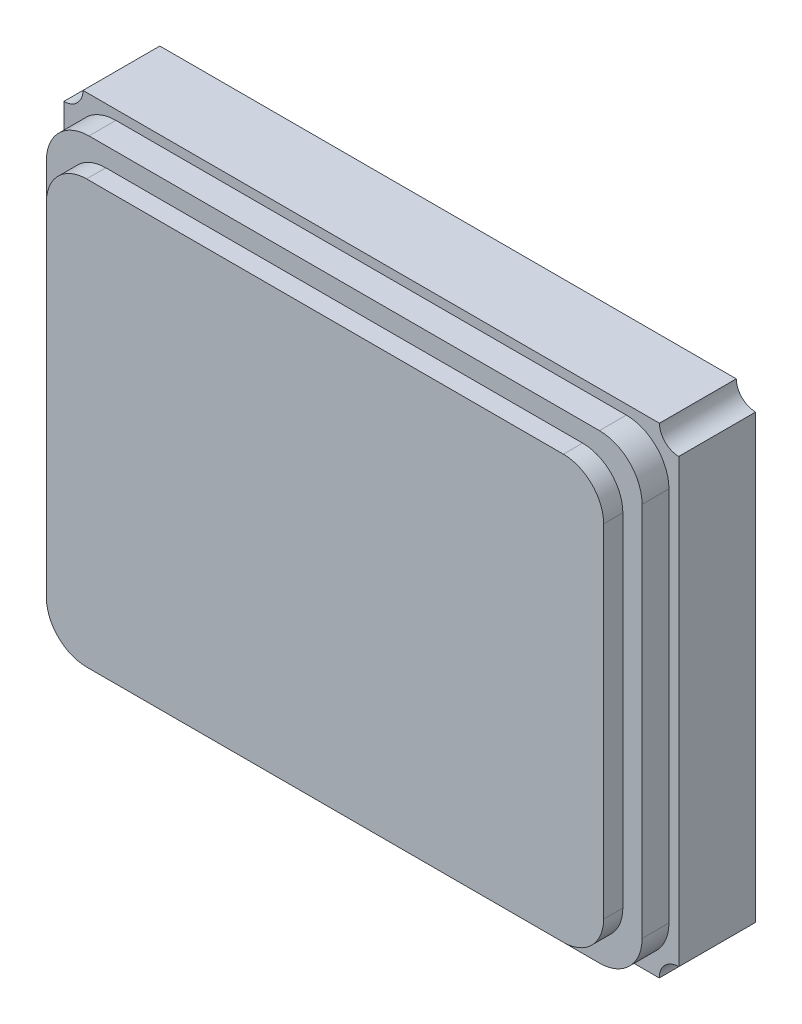
ISO-10303-21;
HEADER;
FILE_DESCRIPTION(('STEP AP214'),'2;1');
FILE_NAME('part.step','',(''),(''),'','','');
FILE_SCHEMA(('AUTOMOTIVE_DESIGN { 1 0 10303 214 1 1 1 1 }'));
ENDSEC;
DATA;
#1=APPLICATION_CONTEXT('core data for automotive mechanical design processes');
#2=APPLICATION_PROTOCOL_DEFINITION('international standard','automotive_design',2000,#1);
#3=PRODUCT_CONTEXT('',#1,'mechanical');
#4=PRODUCT('Part','Part','',(#3));
#5=PRODUCT_RELATED_PRODUCT_CATEGORY('part','',(#4));
#6=PRODUCT_DEFINITION_FORMATION('','',#4);
#7=PRODUCT_DEFINITION_CONTEXT('part definition',#1,'design');
#8=PRODUCT_DEFINITION('design','',#6,#7);
#9=PRODUCT_DEFINITION_SHAPE('','',#8);
#10=(LENGTH_UNIT() NAMED_UNIT(*) SI_UNIT(.MILLI.,.METRE.));
#11=(NAMED_UNIT(*) PLANE_ANGLE_UNIT() SI_UNIT($,.RADIAN.));
#12=(NAMED_UNIT(*) SI_UNIT($,.STERADIAN.) SOLID_ANGLE_UNIT());
#13=UNCERTAINTY_MEASURE_WITH_UNIT(LENGTH_MEASURE(1.E-05),#10,'distance_accuracy_value','');
#14=(GEOMETRIC_REPRESENTATION_CONTEXT(3) GLOBAL_UNCERTAINTY_ASSIGNED_CONTEXT((#13)) GLOBAL_UNIT_ASSIGNED_CONTEXT((#10,
#11,#12)) REPRESENTATION_CONTEXT('',''));
#15=CARTESIAN_POINT('',(0.,0.,0.));
#16=DIRECTION('',(0.,0.,1.));
#17=DIRECTION('',(1.,0.,0.));
#18=AXIS2_PLACEMENT_3D('',#15,#16,#17);
#19=CARTESIAN_POINT('',(0.0008802163144183,-0.0008850774637298,0.));
#20=DIRECTION('',(0.,0.,1.));
#21=DIRECTION('',(1.,0.,0.));
#22=AXIS2_PLACEMENT_3D('',#19,#20,#21);
#23=PLANE('',#22);
#24=DIRECTION('',(1.,0.,0.));
#25=VECTOR('',#24,1.);
#26=CARTESIAN_POINT('',(-1.499580396422,1.249506131818,0.));
#27=LINE('',#26,#25);
#28=CARTESIAN_POINT('',(-1.499580396422,1.249506131818,0.));
#29=VERTEX_POINT('',#28);
#30=CARTESIAN_POINT('',(1.500419603578,1.249506131818,0.));
#31=VERTEX_POINT('',#30);
#32=EDGE_CURVE('E376',#29,#31,#27,.T.);
#33=ORIENTED_EDGE('',*,*,#32,.T.);
#34=CARTESIAN_POINT('',(1.600419603578,1.250214196517,0.));
#35=DIRECTION('',(0.,0.,1.));
#36=DIRECTION('',(1.,0.,0.));
#37=AXIS2_PLACEMENT_3D('',#34,#35,#36);
#38=CIRCLE('',#37,0.100002506747);
#39=CARTESIAN_POINT('',(1.601127668277,1.150214196517,0.));
#40=VERTEX_POINT('',#39);
#41=EDGE_CURVE('E393',#31,#40,#38,.T.);
#42=ORIENTED_EDGE('',*,*,#41,.T.);
#43=DIRECTION('',(0.,-1.,0.));
#44=VECTOR('',#43,1.);
#45=CARTESIAN_POINT('',(1.601127668277,1.150214196517,0.));
#46=LINE('',#45,#44);
#47=CARTESIAN_POINT('',(1.601127668277,-1.149785803483,0.));
#48=VERTEX_POINT('',#47);
#49=EDGE_CURVE('E389',#40,#48,#46,.T.);
#50=ORIENTED_EDGE('',*,*,#49,.T.);
#51=CARTESIAN_POINT('',(1.599580396422,-1.249785803483,0.));
#52=DIRECTION('',(0.,0.,1.));
#53=DIRECTION('',(1.,0.,0.));
#54=AXIS2_PLACEMENT_3D('',#51,#52,#53);
#55=CIRCLE('',#54,0.100011969535);
#56=CARTESIAN_POINT('',(1.499580396422,-1.251333075338,0.));
#57=VERTEX_POINT('',#56);
#58=EDGE_CURVE('E25',#48,#57,#55,.T.);
#59=ORIENTED_EDGE('',*,*,#58,.T.);
#60=DIRECTION('',(-1.,0.,0.));
#61=VECTOR('',#60,1.);
#62=CARTESIAN_POINT('',(1.499580396422,-1.251333075338,0.));
#63=LINE('',#62,#61);
#64=CARTESIAN_POINT('',(-1.500419603578,-1.251333075338,0.));
#65=VERTEX_POINT('',#64);
#66=EDGE_CURVE('E11',#57,#65,#63,.T.);
#67=ORIENTED_EDGE('',*,*,#66,.T.);
#68=CARTESIAN_POINT('',(-1.600419603578,-1.250214196517,0.));
#69=DIRECTION('',(0.,0.,1.));
#70=DIRECTION('',(1.,0.,0.));
#71=AXIS2_PLACEMENT_3D('',#68,#69,#70);
#72=CIRCLE('',#71,0.100006259253);
#73=CARTESIAN_POINT('',(-1.599300724757,-1.150214196517,0.));
#74=VERTEX_POINT('',#73);
#75=EDGE_CURVE('E330',#65,#74,#72,.T.);
#76=ORIENTED_EDGE('',*,*,#75,.T.);
#77=DIRECTION('',(0.,1.,0.));
#78=VECTOR('',#77,1.);
#79=CARTESIAN_POINT('',(-1.599300724757,-1.150214196517,0.));
#80=LINE('',#79,#78);
#81=CARTESIAN_POINT('',(-1.599300724757,1.149785803483,0.));
#82=VERTEX_POINT('',#81);
#83=EDGE_CURVE('E390',#74,#82,#80,.T.);
#84=ORIENTED_EDGE('',*,*,#83,.T.);
#85=CARTESIAN_POINT('',(-1.599580396422,1.249785803483,0.));
#86=DIRECTION('',(0.,0.,1.));
#87=DIRECTION('',(1.,0.,0.));
#88=AXIS2_PLACEMENT_3D('',#85,#86,#87);
#89=CIRCLE('',#88,0.10000039108);
#90=EDGE_CURVE('E382',#82,#29,#89,.T.);
#91=ORIENTED_EDGE('',*,*,#90,.T.);
#92=EDGE_LOOP('',(#33,#42,#50,#59,#67,#76,#84,#91));
#93=FACE_BOUND('',#92,.T.);
#94=ADVANCED_FACE('F17',(#93),#23,.F.);
#95=CARTESIAN_POINT('',(1.499580396422,-1.251333075338,0.));
#96=DIRECTION('',(0.,-1.,0.));
#97=DIRECTION('',(0.,0.,-1.));
#98=AXIS2_PLACEMENT_3D('',#95,#96,#97);
#99=PLANE('',#98);
#100=DIRECTION('',(0.,0.,1.));
#101=VECTOR('',#100,1.);
#102=CARTESIAN_POINT('',(1.499580396422,-1.251333075338,0.));
#103=LINE('',#102,#101);
#104=CARTESIAN_POINT('',(1.499580396422,-1.251333075338,0.4));
#105=VERTEX_POINT('',#104);
#106=EDGE_CURVE('E327',#57,#105,#103,.T.);
#107=ORIENTED_EDGE('',*,*,#106,.T.);
#108=DIRECTION('',(-1.,0.,0.));
#109=VECTOR('',#108,1.);
#110=CARTESIAN_POINT('',(1.499580396422,-1.251333075338,0.4));
#111=LINE('',#110,#109);
#112=CARTESIAN_POINT('',(-1.500419603578,-1.251333075338,0.4));
#113=VERTEX_POINT('',#112);
#114=EDGE_CURVE('E348',#105,#113,#111,.T.);
#115=ORIENTED_EDGE('',*,*,#114,.T.);
#116=DIRECTION('',(0.,0.,1.));
#117=VECTOR('',#116,1.);
#118=CARTESIAN_POINT('',(-1.500419603578,-1.251333075338,0.));
#119=LINE('',#118,#117);
#120=EDGE_CURVE('E336',#65,#113,#119,.T.);
#121=ORIENTED_EDGE('',*,*,#120,.F.);
#122=ORIENTED_EDGE('',*,*,#66,.F.);
#123=EDGE_LOOP('',(#107,#115,#121,#122));
#124=FACE_BOUND('',#123,.T.);
#125=ADVANCED_FACE('F409',(#124),#99,.T.);
#126=CARTESIAN_POINT('',(1.599580396422,-1.249785803483,0.));
#127=DIRECTION('',(0.,0.,-1.));
#128=DIRECTION('',(1.,0.,0.));
#129=AXIS2_PLACEMENT_3D('',#126,#127,#128);
#130=CYLINDRICAL_SURFACE('',#129,0.100011969535);
#131=DIRECTION('',(0.,0.,1.));
#132=VECTOR('',#131,1.);
#133=CARTESIAN_POINT('',(1.601127668277,-1.149785803483,0.));
#134=LINE('',#133,#132);
#135=CARTESIAN_POINT('',(1.601127668277,-1.149785803483,0.4));
#136=VERTEX_POINT('',#135);
#137=EDGE_CURVE('E386',#48,#136,#134,.T.);
#138=ORIENTED_EDGE('',*,*,#137,.T.);
#139=CARTESIAN_POINT('',(1.599580396422,-1.249785803483,0.4));
#140=DIRECTION('',(0.,0.,1.));
#141=DIRECTION('',(1.,0.,0.));
#142=AXIS2_PLACEMENT_3D('',#139,#140,#141);
#143=CIRCLE('',#142,0.100011969535);
#144=EDGE_CURVE('E352',#136,#105,#143,.T.);
#145=ORIENTED_EDGE('',*,*,#144,.T.);
#146=ORIENTED_EDGE('',*,*,#106,.F.);
#147=ORIENTED_EDGE('',*,*,#58,.F.);
#148=EDGE_LOOP('',(#138,#145,#146,#147));
#149=FACE_BOUND('',#148,.T.);
#150=ADVANCED_FACE('F406',(#149),#130,.F.);
#151=CARTESIAN_POINT('',(-1.600419603578,-1.250214196517,0.));
#152=DIRECTION('',(0.,0.,-1.));
#153=DIRECTION('',(1.,0.,0.));
#154=AXIS2_PLACEMENT_3D('',#151,#152,#153);
#155=CYLINDRICAL_SURFACE('',#154,0.100006259253);
#156=ORIENTED_EDGE('',*,*,#120,.T.);
#157=CARTESIAN_POINT('',(-1.600419603578,-1.250214196517,0.4));
#158=DIRECTION('',(0.,0.,1.));
#159=DIRECTION('',(1.,0.,0.));
#160=AXIS2_PLACEMENT_3D('',#157,#158,#159);
#161=CIRCLE('',#160,0.100006259253);
#162=CARTESIAN_POINT('',(-1.599300724757,-1.150214196517,0.4));
#163=VERTEX_POINT('',#162);
#164=EDGE_CURVE('E353',#113,#163,#161,.T.);
#165=ORIENTED_EDGE('',*,*,#164,.T.);
#166=DIRECTION('',(0.,0.,1.));
#167=VECTOR('',#166,1.);
#168=CARTESIAN_POINT('',(-1.599300724757,-1.150214196517,0.));
#169=LINE('',#168,#167);
#170=EDGE_CURVE('E420',#74,#163,#169,.T.);
#171=ORIENTED_EDGE('',*,*,#170,.F.);
#172=ORIENTED_EDGE('',*,*,#75,.F.);
#173=EDGE_LOOP('',(#156,#165,#171,#172));
#174=FACE_BOUND('',#173,.T.);
#175=ADVANCED_FACE('F419',(#174),#155,.F.);
#176=CARTESIAN_POINT('',(1.601127668277,1.150214196517,0.));
#177=DIRECTION('',(1.,0.,0.));
#178=DIRECTION('',(0.,1.,0.));
#179=AXIS2_PLACEMENT_3D('',#176,#177,#178);
#180=PLANE('',#179);
#181=DIRECTION('',(0.,0.,1.));
#182=VECTOR('',#181,1.);
#183=CARTESIAN_POINT('',(1.601127668277,1.150214196517,0.));
#184=LINE('',#183,#182);
#185=CARTESIAN_POINT('',(1.601127668277,1.150214196517,0.4));
#186=VERTEX_POINT('',#185);
#187=EDGE_CURVE('E385',#40,#186,#184,.T.);
#188=ORIENTED_EDGE('',*,*,#187,.T.);
#189=DIRECTION('',(0.,-1.,0.));
#190=VECTOR('',#189,1.);
#191=CARTESIAN_POINT('',(1.601127668277,1.150214196517,0.4));
#192=LINE('',#191,#190);
#193=EDGE_CURVE('E364',#186,#136,#192,.T.);
#194=ORIENTED_EDGE('',*,*,#193,.T.);
#195=ORIENTED_EDGE('',*,*,#137,.F.);
#196=ORIENTED_EDGE('',*,*,#49,.F.);
#197=EDGE_LOOP('',(#188,#194,#195,#196));
#198=FACE_BOUND('',#197,.T.);
#199=ADVANCED_FACE('F492',(#198),#180,.T.);
#200=CARTESIAN_POINT('',(-1.599300724757,-1.150214196517,0.));
#201=DIRECTION('',(-1.,0.,0.));
#202=DIRECTION('',(0.,0.,1.));
#203=AXIS2_PLACEMENT_3D('',#200,#201,#202);
#204=PLANE('',#203);
#205=ORIENTED_EDGE('',*,*,#170,.T.);
#206=DIRECTION('',(0.,1.,0.));
#207=VECTOR('',#206,1.);
#208=CARTESIAN_POINT('',(-1.599300724757,-1.150214196517,0.4));
#209=LINE('',#208,#207);
#210=CARTESIAN_POINT('',(-1.599300724757,1.149785803483,0.4));
#211=VERTEX_POINT('',#210);
#212=EDGE_CURVE('E270',#163,#211,#209,.T.);
#213=ORIENTED_EDGE('',*,*,#212,.T.);
#214=DIRECTION('',(0.,0.,1.));
#215=VECTOR('',#214,1.);
#216=CARTESIAN_POINT('',(-1.599300724757,1.149785803483,0.));
#217=LINE('',#216,#215);
#218=EDGE_CURVE('E379',#82,#211,#217,.T.);
#219=ORIENTED_EDGE('',*,*,#218,.F.);
#220=ORIENTED_EDGE('',*,*,#83,.F.);
#221=EDGE_LOOP('',(#205,#213,#219,#220));
#222=FACE_BOUND('',#221,.T.);
#223=ADVANCED_FACE('F425',(#222),#204,.T.);
#224=CARTESIAN_POINT('',(1.600419603578,1.250214196517,0.));
#225=DIRECTION('',(0.,0.,-1.));
#226=DIRECTION('',(1.,0.,0.));
#227=AXIS2_PLACEMENT_3D('',#224,#225,#226);
#228=CYLINDRICAL_SURFACE('',#227,0.100002506747);
#229=DIRECTION('',(0.,0.,1.));
#230=VECTOR('',#229,1.);
#231=CARTESIAN_POINT('',(1.500419603578,1.249506131818,0.));
#232=LINE('',#231,#230);
#233=CARTESIAN_POINT('',(1.500419603578,1.249506131818,0.4));
#234=VERTEX_POINT('',#233);
#235=EDGE_CURVE('E373',#31,#234,#232,.T.);
#236=ORIENTED_EDGE('',*,*,#235,.T.);
#237=CARTESIAN_POINT('',(1.600419603578,1.250214196517,0.4));
#238=DIRECTION('',(0.,0.,1.));
#239=DIRECTION('',(1.,0.,0.));
#240=AXIS2_PLACEMENT_3D('',#237,#238,#239);
#241=CIRCLE('',#240,0.100002506747);
#242=EDGE_CURVE('E368',#234,#186,#241,.T.);
#243=ORIENTED_EDGE('',*,*,#242,.T.);
#244=ORIENTED_EDGE('',*,*,#187,.F.);
#245=ORIENTED_EDGE('',*,*,#41,.F.);
#246=EDGE_LOOP('',(#236,#243,#244,#245));
#247=FACE_BOUND('',#246,.T.);
#248=ADVANCED_FACE('F489',(#247),#228,.F.);
#249=CARTESIAN_POINT('',(-1.599580396422,1.249785803483,0.));
#250=DIRECTION('',(0.,0.,-1.));
#251=DIRECTION('',(1.,0.,0.));
#252=AXIS2_PLACEMENT_3D('',#249,#250,#251);
#253=CYLINDRICAL_SURFACE('',#252,0.10000039108);
#254=ORIENTED_EDGE('',*,*,#218,.T.);
#255=CARTESIAN_POINT('',(-1.599580396422,1.249785803483,0.4));
#256=DIRECTION('',(0.,0.,1.));
#257=DIRECTION('',(1.,0.,0.));
#258=AXIS2_PLACEMENT_3D('',#255,#256,#257);
#259=CIRCLE('',#258,0.10000039108);
#260=CARTESIAN_POINT('',(-1.499580396422,1.249506131818,0.4));
#261=VERTEX_POINT('',#260);
#262=EDGE_CURVE('E266',#211,#261,#259,.T.);
#263=ORIENTED_EDGE('',*,*,#262,.T.);
#264=DIRECTION('',(0.,0.,1.));
#265=VECTOR('',#264,1.);
#266=CARTESIAN_POINT('',(-1.499580396422,1.249506131818,0.));
#267=LINE('',#266,#265);
#268=EDGE_CURVE('E372',#29,#261,#267,.T.);
#269=ORIENTED_EDGE('',*,*,#268,.F.);
#270=ORIENTED_EDGE('',*,*,#90,.F.);
#271=EDGE_LOOP('',(#254,#263,#269,#270));
#272=FACE_BOUND('',#271,.T.);
#273=ADVANCED_FACE('F555',(#272),#253,.F.);
#274=CARTESIAN_POINT('',(-1.499580396422,1.249506131818,0.));
#275=DIRECTION('',(0.,1.,0.));
#276=DIRECTION('',(1.,0.,0.));
#277=AXIS2_PLACEMENT_3D('',#274,#275,#276);
#278=PLANE('',#277);
#279=ORIENTED_EDGE('',*,*,#268,.T.);
#280=DIRECTION('',(1.,0.,0.));
#281=VECTOR('',#280,1.);
#282=CARTESIAN_POINT('',(-1.499580396422,1.249506131818,0.4));
#283=LINE('',#282,#281);
#284=EDGE_CURVE('E271',#261,#234,#283,.T.);
#285=ORIENTED_EDGE('',*,*,#284,.T.);
#286=ORIENTED_EDGE('',*,*,#235,.F.);
#287=ORIENTED_EDGE('',*,*,#32,.F.);
#288=EDGE_LOOP('',(#279,#285,#286,#287));
#289=FACE_BOUND('',#288,.T.);
#290=ADVANCED_FACE('F486',(#289),#278,.T.);
#291=CARTESIAN_POINT('',(0.0008802163144183,-0.0008850774637298,0.4));
#292=DIRECTION('',(0.,0.,1.));
#293=DIRECTION('',(1.,0.,0.));
#294=AXIS2_PLACEMENT_3D('',#291,#292,#293);
#295=PLANE('',#294);
#296=CARTESIAN_POINT('',(1.328205850256,-0.978205850256,0.4));
#297=DIRECTION('',(0.,0.,-1.));
#298=DIRECTION('',(1.,0.,0.));
#299=AXIS2_PLACEMENT_3D('',#296,#297,#298);
#300=CIRCLE('',#299,0.221794149744);
#301=CARTESIAN_POINT('',(1.55,-0.978205850256,0.4));
#302=VERTEX_POINT('',#301);
#303=CARTESIAN_POINT('',(1.328205850256,-1.2,0.4));
#304=VERTEX_POINT('',#303);
#305=EDGE_CURVE('E319',#302,#304,#300,.T.);
#306=ORIENTED_EDGE('',*,*,#305,.T.);
#307=DIRECTION('',(-1.,0.,0.));
#308=VECTOR('',#307,1.);
#309=CARTESIAN_POINT('',(-0.663662816971,-1.2,0.4));
#310=LINE('',#309,#308);
#311=CARTESIAN_POINT('',(-1.328205850256,-1.2,0.4));
#312=VERTEX_POINT('',#311);
#313=EDGE_CURVE('E308',#304,#312,#310,.T.);
#314=ORIENTED_EDGE('',*,*,#313,.T.);
#315=CARTESIAN_POINT('',(-1.328205850256,-0.978205850256,0.4));
#316=DIRECTION('',(0.,0.,-1.));
#317=DIRECTION('',(1.,0.,0.));
#318=AXIS2_PLACEMENT_3D('',#315,#316,#317);
#319=CIRCLE('',#318,0.221794149744);
#320=CARTESIAN_POINT('',(-1.55,-0.978205850256,0.4));
#321=VERTEX_POINT('',#320);
#322=EDGE_CURVE('E315',#312,#321,#319,.T.);
#323=ORIENTED_EDGE('',*,*,#322,.T.);
#324=DIRECTION('',(0.,1.,0.));
#325=VECTOR('',#324,1.);
#326=CARTESIAN_POINT('',(-1.55,0.488660386396,0.4));
#327=LINE('',#326,#325);
#328=CARTESIAN_POINT('',(-1.55,0.978205850256,0.4));
#329=VERTEX_POINT('',#328);
#330=EDGE_CURVE('E326',#321,#329,#327,.T.);
#331=ORIENTED_EDGE('',*,*,#330,.T.);
#332=CARTESIAN_POINT('',(-1.328205850256,0.978205850256,0.4));
#333=DIRECTION('',(0.,0.,-1.));
#334=DIRECTION('',(1.,0.,0.));
#335=AXIS2_PLACEMENT_3D('',#332,#333,#334);
#336=CIRCLE('',#335,0.221794149744);
#337=CARTESIAN_POINT('',(-1.328205850256,1.2,0.4));
#338=VERTEX_POINT('',#337);
#339=EDGE_CURVE('E343',#329,#338,#336,.T.);
#340=ORIENTED_EDGE('',*,*,#339,.T.);
#341=DIRECTION('',(1.,0.,0.));
#342=VECTOR('',#341,1.);
#343=CARTESIAN_POINT('',(0.664543033285,1.2,0.4));
#344=LINE('',#343,#342);
#345=CARTESIAN_POINT('',(1.328205850256,1.2,0.4));
#346=VERTEX_POINT('',#345);
#347=EDGE_CURVE('E275',#338,#346,#344,.T.);
#348=ORIENTED_EDGE('',*,*,#347,.T.);
#349=CARTESIAN_POINT('',(1.328205850256,0.978205850256,0.4));
#350=DIRECTION('',(0.,0.,-1.));
#351=DIRECTION('',(1.,0.,0.));
#352=AXIS2_PLACEMENT_3D('',#349,#350,#351);
#353=CIRCLE('',#352,0.221794149744);
#354=CARTESIAN_POINT('',(1.55,0.978205850256,0.4));
#355=VERTEX_POINT('',#354);
#356=EDGE_CURVE('E278',#346,#355,#353,.T.);
#357=ORIENTED_EDGE('',*,*,#356,.T.);
#358=DIRECTION('',(0.,-1.,0.));
#359=VECTOR('',#358,1.);
#360=CARTESIAN_POINT('',(1.55,-0.48954546386,0.4));
#361=LINE('',#360,#359);
#362=EDGE_CURVE('E337',#355,#302,#361,.T.);
#363=ORIENTED_EDGE('',*,*,#362,.T.);
#364=EDGE_LOOP('',(#306,#314,#323,#331,#340,#348,#357,#363));
#365=FACE_BOUND('',#364,.T.);
#366=ORIENTED_EDGE('',*,*,#284,.F.);
#367=ORIENTED_EDGE('',*,*,#262,.F.);
#368=ORIENTED_EDGE('',*,*,#212,.F.);
#369=ORIENTED_EDGE('',*,*,#164,.F.);
#370=ORIENTED_EDGE('',*,*,#114,.F.);
#371=ORIENTED_EDGE('',*,*,#144,.F.);
#372=ORIENTED_EDGE('',*,*,#193,.F.);
#373=ORIENTED_EDGE('',*,*,#242,.F.);
#374=EDGE_LOOP('',(#366,#367,#368,#369,#370,#371,#372,#373));
#375=FACE_BOUND('',#374,.T.);
#376=ADVANCED_FACE('F414',(#365,#375),#295,.T.);
#377=CARTESIAN_POINT('',(1.328205850256,1.2,0.39));
#378=DIRECTION('',(0.,-1.,0.));
#379=DIRECTION('',(0.,0.,-1.));
#380=AXIS2_PLACEMENT_3D('',#377,#378,#379);
#381=PLANE('',#380);
#382=DIRECTION('',(0.,0.,1.));
#383=VECTOR('',#382,1.);
#384=CARTESIAN_POINT('',(-1.328205850256,1.2,0.39));
#385=LINE('',#384,#383);
#386=CARTESIAN_POINT('',(-1.328205850256,1.2,0.54));
#387=VERTEX_POINT('',#386);
#388=EDGE_CURVE('E340',#338,#387,#385,.T.);
#389=ORIENTED_EDGE('',*,*,#388,.T.);
#390=DIRECTION('',(-1.,0.,0.));
#391=VECTOR('',#390,1.);
#392=CARTESIAN_POINT('',(1.328205850256,1.2,0.54));
#393=LINE('',#392,#391);
#394=CARTESIAN_POINT('',(1.328205850256,1.2,0.54));
#395=VERTEX_POINT('',#394);
#396=EDGE_CURVE('E291',#395,#387,#393,.T.);
#397=ORIENTED_EDGE('',*,*,#396,.F.);
#398=DIRECTION('',(0.,0.,1.));
#399=VECTOR('',#398,1.);
#400=CARTESIAN_POINT('',(1.328205850256,1.2,0.39));
#401=LINE('',#400,#399);
#402=EDGE_CURVE('E347',#346,#395,#401,.T.);
#403=ORIENTED_EDGE('',*,*,#402,.F.);
#404=ORIENTED_EDGE('',*,*,#347,.F.);
#405=EDGE_LOOP('',(#389,#397,#403,#404));
#406=FACE_BOUND('',#405,.T.);
#407=ADVANCED_FACE('F537',(#406),#381,.F.);
#408=CARTESIAN_POINT('',(1.328205850256,0.978205850256,0.39));
#409=DIRECTION('',(0.,0.,-1.));
#410=DIRECTION('',(1.,0.,0.));
#411=AXIS2_PLACEMENT_3D('',#408,#409,#410);
#412=CYLINDRICAL_SURFACE('',#411,0.221794149744);
#413=ORIENTED_EDGE('',*,*,#402,.T.);
#414=CARTESIAN_POINT('',(1.328205850256,0.978205850256,0.54));
#415=DIRECTION('',(0.,0.,1.));
#416=DIRECTION('',(1.,0.,0.));
#417=AXIS2_PLACEMENT_3D('',#414,#415,#416);
#418=CIRCLE('',#417,0.221794149744);
#419=CARTESIAN_POINT('',(1.55,0.978205850256,0.54));
#420=VERTEX_POINT('',#419);
#421=EDGE_CURVE('E287',#420,#395,#418,.T.);
#422=ORIENTED_EDGE('',*,*,#421,.F.);
#423=DIRECTION('',(0.,0.,1.));
#424=VECTOR('',#423,1.);
#425=CARTESIAN_POINT('',(1.55,0.978205850256,0.39));
#426=LINE('',#425,#424);
#427=EDGE_CURVE('E262',#355,#420,#426,.T.);
#428=ORIENTED_EDGE('',*,*,#427,.F.);
#429=ORIENTED_EDGE('',*,*,#356,.F.);
#430=EDGE_LOOP('',(#413,#422,#428,#429));
#431=FACE_BOUND('',#430,.T.);
#432=ADVANCED_FACE('F544',(#431),#412,.T.);
#433=CARTESIAN_POINT('',(-1.328205850256,0.978205850256,0.39));
#434=DIRECTION('',(0.,0.,-1.));
#435=DIRECTION('',(1.,0.,0.));
#436=AXIS2_PLACEMENT_3D('',#433,#434,#435);
#437=CYLINDRICAL_SURFACE('',#436,0.221794149744);
#438=DIRECTION('',(0.,0.,1.));
#439=VECTOR('',#438,1.);
#440=CARTESIAN_POINT('',(-1.55,0.978205850256,0.39));
#441=LINE('',#440,#439);
#442=CARTESIAN_POINT('',(-1.55,0.978205850256,0.54));
#443=VERTEX_POINT('',#442);
#444=EDGE_CURVE('E323',#329,#443,#441,.T.);
#445=ORIENTED_EDGE('',*,*,#444,.T.);
#446=CARTESIAN_POINT('',(-1.328205850256,0.978205850256,0.54));
#447=DIRECTION('',(0.,0.,1.));
#448=DIRECTION('',(1.,0.,0.));
#449=AXIS2_PLACEMENT_3D('',#446,#447,#448);
#450=CIRCLE('',#449,0.221794149744);
#451=EDGE_CURVE('E292',#387,#443,#450,.T.);
#452=ORIENTED_EDGE('',*,*,#451,.F.);
#453=ORIENTED_EDGE('',*,*,#388,.F.);
#454=ORIENTED_EDGE('',*,*,#339,.F.);
#455=EDGE_LOOP('',(#445,#452,#453,#454));
#456=FACE_BOUND('',#455,.T.);
#457=ADVANCED_FACE('F518',(#456),#437,.T.);
#458=CARTESIAN_POINT('',(1.55,-0.978205850256,0.39));
#459=DIRECTION('',(-1.,0.,0.));
#460=DIRECTION('',(0.,0.,1.));
#461=AXIS2_PLACEMENT_3D('',#458,#459,#460);
#462=PLANE('',#461);
#463=ORIENTED_EDGE('',*,*,#427,.T.);
#464=DIRECTION('',(0.,1.,0.));
#465=VECTOR('',#464,1.);
#466=CARTESIAN_POINT('',(1.55,-0.978205850256,0.54));
#467=LINE('',#466,#465);
#468=CARTESIAN_POINT('',(1.55,-0.978205850256,0.54));
#469=VERTEX_POINT('',#468);
#470=EDGE_CURVE('E283',#469,#420,#467,.T.);
#471=ORIENTED_EDGE('',*,*,#470,.F.);
#472=DIRECTION('',(0.,0.,1.));
#473=VECTOR('',#472,1.);
#474=CARTESIAN_POINT('',(1.55,-0.978205850256,0.39));
#475=LINE('',#474,#473);
#476=EDGE_CURVE('E316',#302,#469,#475,.T.);
#477=ORIENTED_EDGE('',*,*,#476,.F.);
#478=ORIENTED_EDGE('',*,*,#362,.F.);
#479=EDGE_LOOP('',(#463,#471,#477,#478));
#480=FACE_BOUND('',#479,.T.);
#481=ADVANCED_FACE('F514',(#480),#462,.F.);
#482=CARTESIAN_POINT('',(-1.55,0.978205850256,0.39));
#483=DIRECTION('',(1.,0.,0.));
#484=DIRECTION('',(0.,1.,0.));
#485=AXIS2_PLACEMENT_3D('',#482,#483,#484);
#486=PLANE('',#485);
#487=DIRECTION('',(0.,0.,1.));
#488=VECTOR('',#487,1.);
#489=CARTESIAN_POINT('',(-1.55,-0.978205850256,0.39));
#490=LINE('',#489,#488);
#491=CARTESIAN_POINT('',(-1.55,-0.978205850256,0.54));
#492=VERTEX_POINT('',#491);
#493=EDGE_CURVE('E312',#321,#492,#490,.T.);
#494=ORIENTED_EDGE('',*,*,#493,.T.);
#495=DIRECTION('',(0.,-1.,0.));
#496=VECTOR('',#495,1.);
#497=CARTESIAN_POINT('',(-1.55,0.978205850256,0.54));
#498=LINE('',#497,#496);
#499=EDGE_CURVE('E296',#443,#492,#498,.T.);
#500=ORIENTED_EDGE('',*,*,#499,.F.);
#501=ORIENTED_EDGE('',*,*,#444,.F.);
#502=ORIENTED_EDGE('',*,*,#330,.F.);
#503=EDGE_LOOP('',(#494,#500,#501,#502));
#504=FACE_BOUND('',#503,.T.);
#505=ADVANCED_FACE('F517',(#504),#486,.F.);
#506=CARTESIAN_POINT('',(1.328205850256,-0.978205850256,0.39));
#507=DIRECTION('',(0.,0.,-1.));
#508=DIRECTION('',(1.,0.,0.));
#509=AXIS2_PLACEMENT_3D('',#506,#507,#508);
#510=CYLINDRICAL_SURFACE('',#509,0.221794149744);
#511=ORIENTED_EDGE('',*,*,#476,.T.);
#512=CARTESIAN_POINT('',(1.328205850256,-0.978205850256,0.54));
#513=DIRECTION('',(0.,0.,1.));
#514=DIRECTION('',(1.,0.,0.));
#515=AXIS2_PLACEMENT_3D('',#512,#513,#514);
#516=CIRCLE('',#515,0.221794149744);
#517=CARTESIAN_POINT('',(1.328205850256,-1.2,0.54));
#518=VERTEX_POINT('',#517);
#519=EDGE_CURVE('E282',#518,#469,#516,.T.);
#520=ORIENTED_EDGE('',*,*,#519,.F.);
#521=DIRECTION('',(0.,0.,1.));
#522=VECTOR('',#521,1.);
#523=CARTESIAN_POINT('',(1.328205850256,-1.2,0.39));
#524=LINE('',#523,#522);
#525=EDGE_CURVE('E304',#304,#518,#524,.T.);
#526=ORIENTED_EDGE('',*,*,#525,.F.);
#527=ORIENTED_EDGE('',*,*,#305,.F.);
#528=EDGE_LOOP('',(#511,#520,#526,#527));
#529=FACE_BOUND('',#528,.T.);
#530=ADVANCED_FACE('F522',(#529),#510,.T.);
#531=CARTESIAN_POINT('',(-1.328205850256,-0.978205850256,0.39));
#532=DIRECTION('',(0.,0.,-1.));
#533=DIRECTION('',(1.,0.,0.));
#534=AXIS2_PLACEMENT_3D('',#531,#532,#533);
#535=CYLINDRICAL_SURFACE('',#534,0.221794149744);
#536=DIRECTION('',(0.,0.,1.));
#537=VECTOR('',#536,1.);
#538=CARTESIAN_POINT('',(-1.328205850256,-1.2,0.39));
#539=LINE('',#538,#537);
#540=CARTESIAN_POINT('',(-1.328205850256,-1.2,0.54));
#541=VERTEX_POINT('',#540);
#542=EDGE_CURVE('E307',#312,#541,#539,.T.);
#543=ORIENTED_EDGE('',*,*,#542,.T.);
#544=CARTESIAN_POINT('',(-1.328205850256,-0.978205850256,0.54));
#545=DIRECTION('',(0.,0.,1.));
#546=DIRECTION('',(1.,0.,0.));
#547=AXIS2_PLACEMENT_3D('',#544,#545,#546);
#548=CIRCLE('',#547,0.221794149744);
#549=EDGE_CURVE('E300',#492,#541,#548,.T.);
#550=ORIENTED_EDGE('',*,*,#549,.F.);
#551=ORIENTED_EDGE('',*,*,#493,.F.);
#552=ORIENTED_EDGE('',*,*,#322,.F.);
#553=EDGE_LOOP('',(#543,#550,#551,#552));
#554=FACE_BOUND('',#553,.T.);
#555=ADVANCED_FACE('F525',(#554),#535,.T.);
#556=CARTESIAN_POINT('',(-1.328205850256,-1.2,0.39));
#557=DIRECTION('',(0.,1.,0.));
#558=DIRECTION('',(1.,0.,0.));
#559=AXIS2_PLACEMENT_3D('',#556,#557,#558);
#560=PLANE('',#559);
#561=ORIENTED_EDGE('',*,*,#525,.T.);
#562=DIRECTION('',(1.,0.,0.));
#563=VECTOR('',#562,1.);
#564=CARTESIAN_POINT('',(-1.328205850256,-1.2,0.54));
#565=LINE('',#564,#563);
#566=EDGE_CURVE('E274',#541,#518,#565,.T.);
#567=ORIENTED_EDGE('',*,*,#566,.F.);
#568=ORIENTED_EDGE('',*,*,#542,.F.);
#569=ORIENTED_EDGE('',*,*,#313,.F.);
#570=EDGE_LOOP('',(#561,#567,#568,#569));
#571=FACE_BOUND('',#570,.T.);
#572=ADVANCED_FACE('F531',(#571),#560,.F.);
#573=CARTESIAN_POINT('',(0.,0.,0.54));
#574=DIRECTION('',(0.,0.,1.));
#575=DIRECTION('',(1.,0.,0.));
#576=AXIS2_PLACEMENT_3D('',#573,#574,#575);
#577=PLANE('',#576);
#578=DIRECTION('',(1.,0.,0.));
#579=VECTOR('',#578,1.);
#580=CARTESIAN_POINT('',(-1.240692780974,-1.1,0.54));
#581=LINE('',#580,#579);
#582=CARTESIAN_POINT('',(-1.240692780974,-1.1,0.54));
#583=VERTEX_POINT('',#582);
#584=CARTESIAN_POINT('',(1.240692780974,-1.1,0.54));
#585=VERTEX_POINT('',#584);
#586=EDGE_CURVE('E435',#583,#585,#581,.T.);
#587=ORIENTED_EDGE('',*,*,#586,.F.);
#588=CARTESIAN_POINT('',(-1.240692780974,-0.890692780974,0.54));
#589=DIRECTION('',(0.,0.,1.));
#590=DIRECTION('',(1.,0.,0.));
#591=AXIS2_PLACEMENT_3D('',#588,#589,#590);
#592=CIRCLE('',#591,0.209307219026);
#593=CARTESIAN_POINT('',(-1.45,-0.890692780974,0.54));
#594=VERTEX_POINT('',#593);
#595=EDGE_CURVE('E235',#594,#583,#592,.T.);
#596=ORIENTED_EDGE('',*,*,#595,.F.);
#597=DIRECTION('',(0.,-1.,0.));
#598=VECTOR('',#597,1.);
#599=CARTESIAN_POINT('',(-1.45,0.890692780974,0.54));
#600=LINE('',#599,#598);
#601=CARTESIAN_POINT('',(-1.45,0.890692780974,0.54));
#602=VERTEX_POINT('',#601);
#603=EDGE_CURVE('E227',#602,#594,#600,.T.);
#604=ORIENTED_EDGE('',*,*,#603,.F.);
#605=CARTESIAN_POINT('',(-1.240692780974,0.890692780974,0.54));
#606=DIRECTION('',(0.,0.,1.));
#607=DIRECTION('',(1.,0.,0.));
#608=AXIS2_PLACEMENT_3D('',#605,#606,#607);
#609=CIRCLE('',#608,0.209307219026);
#610=CARTESIAN_POINT('',(-1.240692780974,1.1,0.54));
#611=VERTEX_POINT('',#610);
#612=EDGE_CURVE('E233',#611,#602,#609,.T.);
#613=ORIENTED_EDGE('',*,*,#612,.F.);
#614=DIRECTION('',(-1.,0.,0.));
#615=VECTOR('',#614,1.);
#616=CARTESIAN_POINT('',(1.240692780974,1.1,0.54));
#617=LINE('',#616,#615);
#618=CARTESIAN_POINT('',(1.240692780974,1.1,0.54));
#619=VERTEX_POINT('',#618);
#620=EDGE_CURVE('E259',#619,#611,#617,.T.);
#621=ORIENTED_EDGE('',*,*,#620,.F.);
#622=CARTESIAN_POINT('',(1.240692780974,0.890692780974,0.54));
#623=DIRECTION('',(0.,0.,1.));
#624=DIRECTION('',(1.,0.,0.));
#625=AXIS2_PLACEMENT_3D('',#622,#623,#624);
#626=CIRCLE('',#625,0.209307219026);
#627=CARTESIAN_POINT('',(1.45,0.890692780974,0.54));
#628=VERTEX_POINT('',#627);
#629=EDGE_CURVE('E458',#628,#619,#626,.T.);
#630=ORIENTED_EDGE('',*,*,#629,.F.);
#631=DIRECTION('',(0.,1.,0.));
#632=VECTOR('',#631,1.);
#633=CARTESIAN_POINT('',(1.45,-0.890692780974,0.54));
#634=LINE('',#633,#632);
#635=CARTESIAN_POINT('',(1.45,-0.890692780974,0.54));
#636=VERTEX_POINT('',#635);
#637=EDGE_CURVE('E464',#636,#628,#634,.T.);
#638=ORIENTED_EDGE('',*,*,#637,.F.);
#639=CARTESIAN_POINT('',(1.240692780974,-0.890692780974,0.54));
#640=DIRECTION('',(0.,0.,1.));
#641=DIRECTION('',(1.,0.,0.));
#642=AXIS2_PLACEMENT_3D('',#639,#640,#641);
#643=CIRCLE('',#642,0.209307219026);
#644=EDGE_CURVE('E457',#585,#636,#643,.T.);
#645=ORIENTED_EDGE('',*,*,#644,.F.);
#646=EDGE_LOOP('',(#587,#596,#604,#613,#621,#630,#638,#645));
#647=FACE_BOUND('',#646,.T.);
#648=ORIENTED_EDGE('',*,*,#566,.T.);
#649=ORIENTED_EDGE('',*,*,#519,.T.);
#650=ORIENTED_EDGE('',*,*,#470,.T.);
#651=ORIENTED_EDGE('',*,*,#421,.T.);
#652=ORIENTED_EDGE('',*,*,#396,.T.);
#653=ORIENTED_EDGE('',*,*,#451,.T.);
#654=ORIENTED_EDGE('',*,*,#499,.T.);
#655=ORIENTED_EDGE('',*,*,#549,.T.);
#656=EDGE_LOOP('',(#648,#649,#650,#651,#652,#653,#654,#655));
#657=FACE_BOUND('',#656,.T.);
#658=ADVANCED_FACE('F230',(#647,#657),#577,.T.);
#659=CARTESIAN_POINT('',(-1.240692780974,-0.890692780974,0.54));
#660=DIRECTION('',(0.,0.,-1.));
#661=DIRECTION('',(1.,0.,0.));
#662=AXIS2_PLACEMENT_3D('',#659,#660,#661);
#663=CYLINDRICAL_SURFACE('',#662,0.209307219026);
#664=ORIENTED_EDGE('',*,*,#595,.T.);
#665=DIRECTION('',(0.,0.,1.));
#666=VECTOR('',#665,1.);
#667=CARTESIAN_POINT('',(-1.240692780974,-1.1,0.54));
#668=LINE('',#667,#666);
#669=CARTESIAN_POINT('',(-1.240692780974,-1.1,0.64));
#670=VERTEX_POINT('',#669);
#671=EDGE_CURVE('E454',#583,#670,#668,.T.);
#672=ORIENTED_EDGE('',*,*,#671,.T.);
#673=CARTESIAN_POINT('',(-1.240692780974,-0.890692780974,0.64));
#674=DIRECTION('',(0.,0.,1.));
#675=DIRECTION('',(1.,0.,0.));
#676=AXIS2_PLACEMENT_3D('',#673,#674,#675);
#677=CIRCLE('',#676,0.209307219026);
#678=CARTESIAN_POINT('',(-1.45,-0.890692780974,0.64));
#679=VERTEX_POINT('',#678);
#680=EDGE_CURVE('E444',#679,#670,#677,.T.);
#681=ORIENTED_EDGE('',*,*,#680,.F.);
#682=DIRECTION('',(0.,0.,1.));
#683=VECTOR('',#682,1.);
#684=CARTESIAN_POINT('',(-1.45,-0.890692780974,0.54));
#685=LINE('',#684,#683);
#686=EDGE_CURVE('E239',#594,#679,#685,.T.);
#687=ORIENTED_EDGE('',*,*,#686,.F.);
#688=EDGE_LOOP('',(#664,#672,#681,#687));
#689=FACE_BOUND('',#688,.T.);
#690=ADVANCED_FACE('F527',(#689),#663,.T.);
#691=CARTESIAN_POINT('',(-1.45,0.890692780974,0.54));
#692=DIRECTION('',(1.,0.,0.));
#693=DIRECTION('',(0.,1.,0.));
#694=AXIS2_PLACEMENT_3D('',#691,#692,#693);
#695=PLANE('',#694);
#696=ORIENTED_EDGE('',*,*,#603,.T.);
#697=ORIENTED_EDGE('',*,*,#686,.T.);
#698=DIRECTION('',(0.,-1.,0.));
#699=VECTOR('',#698,1.);
#700=CARTESIAN_POINT('',(-1.45,0.890692780974,0.64));
#701=LINE('',#700,#699);
#702=CARTESIAN_POINT('',(-1.45,0.890692780974,0.64));
#703=VERTEX_POINT('',#702);
#704=EDGE_CURVE('E245',#703,#679,#701,.T.);
#705=ORIENTED_EDGE('',*,*,#704,.F.);
#706=DIRECTION('',(0.,0.,1.));
#707=VECTOR('',#706,1.);
#708=CARTESIAN_POINT('',(-1.45,0.890692780974,0.54));
#709=LINE('',#708,#707);
#710=EDGE_CURVE('E240',#602,#703,#709,.T.);
#711=ORIENTED_EDGE('',*,*,#710,.F.);
#712=EDGE_LOOP('',(#696,#697,#705,#711));
#713=FACE_BOUND('',#712,.T.);
#714=ADVANCED_FACE('F243',(#713),#695,.F.);
#715=CARTESIAN_POINT('',(-1.240692780974,0.890692780974,0.54));
#716=DIRECTION('',(0.,0.,-1.));
#717=DIRECTION('',(1.,0.,0.));
#718=AXIS2_PLACEMENT_3D('',#715,#716,#717);
#719=CYLINDRICAL_SURFACE('',#718,0.209307219026);
#720=ORIENTED_EDGE('',*,*,#612,.T.);
#721=ORIENTED_EDGE('',*,*,#710,.T.);
#722=CARTESIAN_POINT('',(-1.240692780974,0.890692780974,0.64));
#723=DIRECTION('',(0.,0.,1.));
#724=DIRECTION('',(1.,0.,0.));
#725=AXIS2_PLACEMENT_3D('',#722,#723,#724);
#726=CIRCLE('',#725,0.209307219026);
#727=CARTESIAN_POINT('',(-1.240692780974,1.1,0.64));
#728=VERTEX_POINT('',#727);
#729=EDGE_CURVE('E437',#728,#703,#726,.T.);
#730=ORIENTED_EDGE('',*,*,#729,.F.);
#731=DIRECTION('',(0.,0.,1.));
#732=VECTOR('',#731,1.);
#733=CARTESIAN_POINT('',(-1.240692780974,1.1,0.54));
#734=LINE('',#733,#732);
#735=EDGE_CURVE('E252',#611,#728,#734,.T.);
#736=ORIENTED_EDGE('',*,*,#735,.F.);
#737=EDGE_LOOP('',(#720,#721,#730,#736));
#738=FACE_BOUND('',#737,.T.);
#739=ADVANCED_FACE('F251',(#738),#719,.T.);
#740=CARTESIAN_POINT('',(1.240692780974,1.1,0.54));
#741=DIRECTION('',(0.,-1.,0.));
#742=DIRECTION('',(0.,0.,-1.));
#743=AXIS2_PLACEMENT_3D('',#740,#741,#742);
#744=PLANE('',#743);
#745=ORIENTED_EDGE('',*,*,#620,.T.);
#746=ORIENTED_EDGE('',*,*,#735,.T.);
#747=DIRECTION('',(-1.,0.,0.));
#748=VECTOR('',#747,1.);
#749=CARTESIAN_POINT('',(1.240692780974,1.1,0.64));
#750=LINE('',#749,#748);
#751=CARTESIAN_POINT('',(1.240692780974,1.1,0.64));
#752=VERTEX_POINT('',#751);
#753=EDGE_CURVE('E439',#752,#728,#750,.T.);
#754=ORIENTED_EDGE('',*,*,#753,.F.);
#755=DIRECTION('',(0.,0.,1.));
#756=VECTOR('',#755,1.);
#757=CARTESIAN_POINT('',(1.240692780974,1.1,0.54));
#758=LINE('',#757,#756);
#759=EDGE_CURVE('E462',#619,#752,#758,.T.);
#760=ORIENTED_EDGE('',*,*,#759,.F.);
#761=EDGE_LOOP('',(#745,#746,#754,#760));
#762=FACE_BOUND('',#761,.T.);
#763=ADVANCED_FACE('F512',(#762),#744,.F.);
#764=CARTESIAN_POINT('',(1.240692780974,0.890692780974,0.54));
#765=DIRECTION('',(0.,0.,-1.));
#766=DIRECTION('',(1.,0.,0.));
#767=AXIS2_PLACEMENT_3D('',#764,#765,#766);
#768=CYLINDRICAL_SURFACE('',#767,0.209307219026);
#769=ORIENTED_EDGE('',*,*,#629,.T.);
#770=ORIENTED_EDGE('',*,*,#759,.T.);
#771=CARTESIAN_POINT('',(1.240692780974,0.890692780974,0.64));
#772=DIRECTION('',(0.,0.,1.));
#773=DIRECTION('',(1.,0.,0.));
#774=AXIS2_PLACEMENT_3D('',#771,#772,#773);
#775=CIRCLE('',#774,0.209307219026);
#776=CARTESIAN_POINT('',(1.45,0.890692780974,0.64));
#777=VERTEX_POINT('',#776);
#778=EDGE_CURVE('E827',#777,#752,#775,.T.);
#779=ORIENTED_EDGE('',*,*,#778,.F.);
#780=DIRECTION('',(0.,0.,1.));
#781=VECTOR('',#780,1.);
#782=CARTESIAN_POINT('',(1.45,0.890692780974,0.54));
#783=LINE('',#782,#781);
#784=EDGE_CURVE('E463',#628,#777,#783,.T.);
#785=ORIENTED_EDGE('',*,*,#784,.F.);
#786=EDGE_LOOP('',(#769,#770,#779,#785));
#787=FACE_BOUND('',#786,.T.);
#788=ADVANCED_FACE('F644',(#787),#768,.T.);
#789=CARTESIAN_POINT('',(1.45,-0.890692780974,0.54));
#790=DIRECTION('',(-1.,0.,0.));
#791=DIRECTION('',(0.,0.,1.));
#792=AXIS2_PLACEMENT_3D('',#789,#790,#791);
#793=PLANE('',#792);
#794=ORIENTED_EDGE('',*,*,#637,.T.);
#795=ORIENTED_EDGE('',*,*,#784,.T.);
#796=DIRECTION('',(0.,1.,0.));
#797=VECTOR('',#796,1.);
#798=CARTESIAN_POINT('',(1.45,-0.890692780974,0.64));
#799=LINE('',#798,#797);
#800=CARTESIAN_POINT('',(1.45,-0.890692780974,0.64));
#801=VERTEX_POINT('',#800);
#802=EDGE_CURVE('E811',#801,#777,#799,.T.);
#803=ORIENTED_EDGE('',*,*,#802,.F.);
#804=DIRECTION('',(0.,0.,1.));
#805=VECTOR('',#804,1.);
#806=CARTESIAN_POINT('',(1.45,-0.890692780974,0.54));
#807=LINE('',#806,#805);
#808=EDGE_CURVE('E467',#636,#801,#807,.T.);
#809=ORIENTED_EDGE('',*,*,#808,.F.);
#810=EDGE_LOOP('',(#794,#795,#803,#809));
#811=FACE_BOUND('',#810,.T.);
#812=ADVANCED_FACE('F651',(#811),#793,.F.);
#813=CARTESIAN_POINT('',(1.240692780974,-0.890692780974,0.54));
#814=DIRECTION('',(0.,0.,-1.));
#815=DIRECTION('',(1.,0.,0.));
#816=AXIS2_PLACEMENT_3D('',#813,#814,#815);
#817=CYLINDRICAL_SURFACE('',#816,0.209307219026);
#818=ORIENTED_EDGE('',*,*,#644,.T.);
#819=ORIENTED_EDGE('',*,*,#808,.T.);
#820=CARTESIAN_POINT('',(1.240692780974,-0.890692780974,0.64));
#821=DIRECTION('',(0.,0.,1.));
#822=DIRECTION('',(1.,0.,0.));
#823=AXIS2_PLACEMENT_3D('',#820,#821,#822);
#824=CIRCLE('',#823,0.209307219026);
#825=CARTESIAN_POINT('',(1.240692780974,-1.1,0.64));
#826=VERTEX_POINT('',#825);
#827=EDGE_CURVE('E802',#826,#801,#824,.T.);
#828=ORIENTED_EDGE('',*,*,#827,.F.);
#829=DIRECTION('',(0.,0.,1.));
#830=VECTOR('',#829,1.);
#831=CARTESIAN_POINT('',(1.240692780974,-1.1,0.54));
#832=LINE('',#831,#830);
#833=EDGE_CURVE('E451',#585,#826,#832,.T.);
#834=ORIENTED_EDGE('',*,*,#833,.F.);
#835=EDGE_LOOP('',(#818,#819,#828,#834));
#836=FACE_BOUND('',#835,.T.);
#837=ADVANCED_FACE('F659',(#836),#817,.T.);
#838=CARTESIAN_POINT('',(-1.240692780974,-1.1,0.54));
#839=DIRECTION('',(0.,1.,0.));
#840=DIRECTION('',(1.,0.,0.));
#841=AXIS2_PLACEMENT_3D('',#838,#839,#840);
#842=PLANE('',#841);
#843=ORIENTED_EDGE('',*,*,#586,.T.);
#844=ORIENTED_EDGE('',*,*,#833,.T.);
#845=DIRECTION('',(1.,0.,0.));
#846=VECTOR('',#845,1.);
#847=CARTESIAN_POINT('',(-1.240692780974,-1.1,0.64));
#848=LINE('',#847,#846);
#849=EDGE_CURVE('E799',#670,#826,#848,.T.);
#850=ORIENTED_EDGE('',*,*,#849,.F.);
#851=ORIENTED_EDGE('',*,*,#671,.F.);
#852=EDGE_LOOP('',(#843,#844,#850,#851));
#853=FACE_BOUND('',#852,.T.);
#854=ADVANCED_FACE('F667',(#853),#842,.F.);
#855=CARTESIAN_POINT('',(0.,0.,0.64));
#856=DIRECTION('',(0.,0.,1.));
#857=DIRECTION('',(0.,-1.,0.));
#858=AXIS2_PLACEMENT_3D('',#855,#856,#857);
#859=PLANE('',#858);
#860=ORIENTED_EDGE('',*,*,#849,.T.);
#861=ORIENTED_EDGE('',*,*,#827,.T.);
#862=ORIENTED_EDGE('',*,*,#802,.T.);
#863=ORIENTED_EDGE('',*,*,#778,.T.);
#864=ORIENTED_EDGE('',*,*,#753,.T.);
#865=ORIENTED_EDGE('',*,*,#729,.T.);
#866=ORIENTED_EDGE('',*,*,#704,.T.);
#867=ORIENTED_EDGE('',*,*,#680,.T.);
#868=EDGE_LOOP('',(#860,#861,#862,#863,#864,#865,#866,#867));
#869=FACE_BOUND('',#868,.T.);
#870=ADVANCED_FACE('F675',(#869),#859,.T.);
#871=CLOSED_SHELL('',(#94,#125,#150,#175,#199,#223,#248,#273,#290,#376,#407,#432,#457,#481,#505,
#530,#555,#572,#658,#690,#714,#739,#763,#788,#812,#837,#854,#870));
#872=MANIFOLD_SOLID_BREP('B1',#871);
#873=ADVANCED_BREP_SHAPE_REPRESENTATION('',(#18,#872),#14);
#874=SHAPE_DEFINITION_REPRESENTATION(#9,#873);
ENDSEC;
END-ISO-10303-21;
